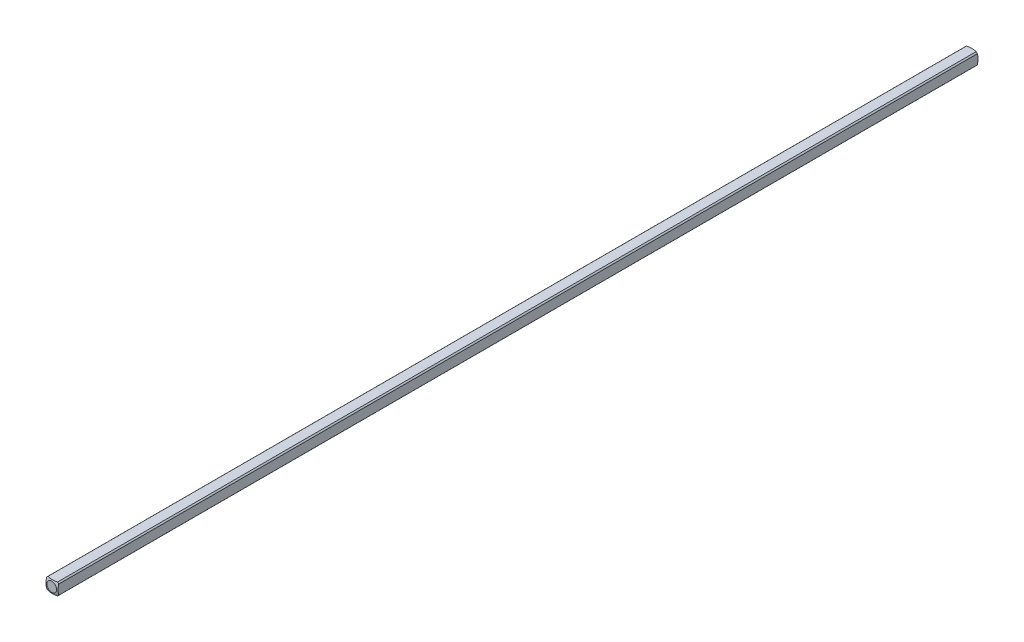
ISO-10303-21;
HEADER;
FILE_DESCRIPTION(('STEP AP214'),'2;1');
FILE_NAME('part.step','',(''),(''),'','','');
FILE_SCHEMA(('AUTOMOTIVE_DESIGN { 1 0 10303 214 1 1 1 1 }'));
ENDSEC;
DATA;
#1=APPLICATION_CONTEXT('core data for automotive mechanical design processes');
#2=APPLICATION_PROTOCOL_DEFINITION('international standard','automotive_design',2000,#1);
#3=PRODUCT_CONTEXT('',#1,'mechanical');
#4=PRODUCT('Part','Part','',(#3));
#5=PRODUCT_RELATED_PRODUCT_CATEGORY('part','',(#4));
#6=PRODUCT_DEFINITION_FORMATION('','',#4);
#7=PRODUCT_DEFINITION_CONTEXT('part definition',#1,'design');
#8=PRODUCT_DEFINITION('design','',#6,#7);
#9=PRODUCT_DEFINITION_SHAPE('','',#8);
#10=(LENGTH_UNIT() NAMED_UNIT(*) SI_UNIT(.MILLI.,.METRE.));
#11=(NAMED_UNIT(*) PLANE_ANGLE_UNIT() SI_UNIT($,.RADIAN.));
#12=(NAMED_UNIT(*) SI_UNIT($,.STERADIAN.) SOLID_ANGLE_UNIT());
#13=UNCERTAINTY_MEASURE_WITH_UNIT(LENGTH_MEASURE(1.E-05),#10,'distance_accuracy_value','');
#14=(GEOMETRIC_REPRESENTATION_CONTEXT(3) GLOBAL_UNCERTAINTY_ASSIGNED_CONTEXT((#13)) GLOBAL_UNIT_ASSIGNED_CONTEXT((#10,
#11,#12)) REPRESENTATION_CONTEXT('',''));
#15=CARTESIAN_POINT('',(0.,0.,0.));
#16=DIRECTION('',(0.,0.,1.));
#17=DIRECTION('',(1.,0.,0.));
#18=AXIS2_PLACEMENT_3D('',#15,#16,#17);
#19=CARTESIAN_POINT('',(-1.5875,-1.5875,120.65));
#20=DIRECTION('',(1.,0.,0.));
#21=DIRECTION('',(0.,0.,-1.));
#22=AXIS2_PLACEMENT_3D('',#19,#20,#21);
#23=PLANE('',#22);
#24=CARTESIAN_POINT('',(-1.5875,0.,4.91912226376204));
#25=DIRECTION('',(1.,0.,0.));
#26=DIRECTION('',(0.,0.,-1.));
#27=AXIS2_PLACEMENT_3D('',#24,#25,#26);
#28=CIRCLE('',#27,4.82558221875869);
#29=CARTESIAN_POINT('',(-1.5875,-1.26841150657032,0.263225357686905));
#30=VERTEX_POINT('',#29);
#31=CARTESIAN_POINT('',(-1.5875,1.26841150657032,0.263225357686955));
#32=VERTEX_POINT('',#31);
#33=EDGE_CURVE('E55',#30,#32,#28,.T.);
#34=ORIENTED_EDGE('',*,*,#33,.F.);
#35=DIRECTION('',(0.,0.,-1.));
#36=VECTOR('',#35,1.);
#37=CARTESIAN_POINT('',(-1.5875,-1.26841150657032,120.65));
#38=LINE('',#37,#36);
#39=CARTESIAN_POINT('',(-1.5875,-1.26841150657032,241.036774642313));
#40=VERTEX_POINT('',#39);
#41=EDGE_CURVE('E48',#40,#30,#38,.T.);
#42=ORIENTED_EDGE('',*,*,#41,.F.);
#43=CARTESIAN_POINT('',(-1.5875,0.,236.380877736238));
#44=DIRECTION('',(-1.,0.,0.));
#45=DIRECTION('',(0.,0.,1.));
#46=AXIS2_PLACEMENT_3D('',#43,#44,#45);
#47=CIRCLE('',#46,4.82558221875869);
#48=CARTESIAN_POINT('',(-1.5875,1.26841150657032,241.036774642313));
#49=VERTEX_POINT('',#48);
#50=EDGE_CURVE('E134',#40,#49,#47,.T.);
#51=ORIENTED_EDGE('',*,*,#50,.T.);
#52=DIRECTION('',(0.,0.,-1.));
#53=VECTOR('',#52,1.);
#54=CARTESIAN_POINT('',(-1.5875,1.26841150657032,120.65));
#55=LINE('',#54,#53);
#56=EDGE_CURVE('E120',#32,#49,#55,.F.);
#57=ORIENTED_EDGE('',*,*,#56,.F.);
#58=EDGE_LOOP('',(#34,#42,#51,#57));
#59=FACE_BOUND('',#58,.T.);
#60=ADVANCED_FACE('F40',(#59),#23,.F.);
#61=CARTESIAN_POINT('',(-1.5875,-1.5875,120.65));
#62=DIRECTION('',(0.,1.,0.));
#63=DIRECTION('',(0.,0.,1.));
#64=AXIS2_PLACEMENT_3D('',#61,#62,#63);
#65=PLANE('',#64);
#66=CARTESIAN_POINT('',(0.,-1.5875,4.91912226376204));
#67=DIRECTION('',(0.,1.,0.));
#68=DIRECTION('',(0.,0.,1.));
#69=AXIS2_PLACEMENT_3D('',#66,#67,#68);
#70=CIRCLE('',#69,4.82558221875869);
#71=CARTESIAN_POINT('',(1.26841150657032,-1.5875,0.263225357686905));
#72=VERTEX_POINT('',#71);
#73=CARTESIAN_POINT('',(-1.26841150657032,-1.5875,0.263225357686933));
#74=VERTEX_POINT('',#73);
#75=EDGE_CURVE('E175',#72,#74,#70,.T.);
#76=ORIENTED_EDGE('',*,*,#75,.F.);
#77=DIRECTION('',(0.,0.,-1.));
#78=VECTOR('',#77,1.);
#79=CARTESIAN_POINT('',(1.26841150657032,-1.5875,120.65));
#80=LINE('',#79,#78);
#81=CARTESIAN_POINT('',(1.26841150657032,-1.5875,241.036774642313));
#82=VERTEX_POINT('',#81);
#83=EDGE_CURVE('E195',#82,#72,#80,.T.);
#84=ORIENTED_EDGE('',*,*,#83,.F.);
#85=CARTESIAN_POINT('',(0.,-1.5875,236.380877736238));
#86=DIRECTION('',(0.,-1.,0.));
#87=DIRECTION('',(0.,0.,-1.));
#88=AXIS2_PLACEMENT_3D('',#85,#86,#87);
#89=CIRCLE('',#88,4.82558221875869);
#90=CARTESIAN_POINT('',(-1.26841150657032,-1.5875,241.036774642313));
#91=VERTEX_POINT('',#90);
#92=EDGE_CURVE('E149',#82,#91,#89,.T.);
#93=ORIENTED_EDGE('',*,*,#92,.T.);
#94=DIRECTION('',(0.,0.,-1.));
#95=VECTOR('',#94,1.);
#96=CARTESIAN_POINT('',(-1.26841150657032,-1.5875,120.65));
#97=LINE('',#96,#95);
#98=EDGE_CURVE('E192',#74,#91,#97,.F.);
#99=ORIENTED_EDGE('',*,*,#98,.F.);
#100=EDGE_LOOP('',(#76,#84,#93,#99));
#101=FACE_BOUND('',#100,.T.);
#102=ADVANCED_FACE('F208',(#101),#65,.F.);
#103=CARTESIAN_POINT('',(1.5875,-1.5875,120.65));
#104=DIRECTION('',(-1.,0.,0.));
#105=DIRECTION('',(0.,0.,1.));
#106=AXIS2_PLACEMENT_3D('',#103,#104,#105);
#107=PLANE('',#106);
#108=CARTESIAN_POINT('',(1.5875,0.,4.91912226376204));
#109=DIRECTION('',(-1.,0.,0.));
#110=DIRECTION('',(0.,0.,1.));
#111=AXIS2_PLACEMENT_3D('',#108,#109,#110);
#112=CIRCLE('',#111,4.82558221875869);
#113=CARTESIAN_POINT('',(1.5875,1.26841150657032,0.263225357686933));
#114=VERTEX_POINT('',#113);
#115=CARTESIAN_POINT('',(1.5875,-1.26841150657032,0.263225357686905));
#116=VERTEX_POINT('',#115);
#117=EDGE_CURVE('E172',#114,#116,#112,.T.);
#118=ORIENTED_EDGE('',*,*,#117,.F.);
#119=DIRECTION('',(0.,0.,-1.));
#120=VECTOR('',#119,1.);
#121=CARTESIAN_POINT('',(1.5875,1.26841150657032,120.65));
#122=LINE('',#121,#120);
#123=CARTESIAN_POINT('',(1.5875,1.26841150657032,241.036774642313));
#124=VERTEX_POINT('',#123);
#125=EDGE_CURVE('E188',#124,#114,#122,.T.);
#126=ORIENTED_EDGE('',*,*,#125,.F.);
#127=CARTESIAN_POINT('',(1.5875,0.,236.380877736238));
#128=DIRECTION('',(1.,0.,0.));
#129=DIRECTION('',(0.,0.,-1.));
#130=AXIS2_PLACEMENT_3D('',#127,#128,#129);
#131=CIRCLE('',#130,4.82558221875869);
#132=CARTESIAN_POINT('',(1.5875,-1.26841150657032,241.036774642313));
#133=VERTEX_POINT('',#132);
#134=EDGE_CURVE('E145',#124,#133,#131,.T.);
#135=ORIENTED_EDGE('',*,*,#134,.T.);
#136=DIRECTION('',(0.,0.,-1.));
#137=VECTOR('',#136,1.);
#138=CARTESIAN_POINT('',(1.5875,-1.26841150657032,120.65));
#139=LINE('',#138,#137);
#140=EDGE_CURVE('E113',#116,#133,#139,.F.);
#141=ORIENTED_EDGE('',*,*,#140,.F.);
#142=EDGE_LOOP('',(#118,#126,#135,#141));
#143=FACE_BOUND('',#142,.T.);
#144=ADVANCED_FACE('F215',(#143),#107,.F.);
#145=CARTESIAN_POINT('',(-1.5875,1.5875,120.65));
#146=DIRECTION('',(0.,-1.,0.));
#147=DIRECTION('',(0.,0.,-1.));
#148=AXIS2_PLACEMENT_3D('',#145,#146,#147);
#149=PLANE('',#148);
#150=CARTESIAN_POINT('',(0.,1.5875,4.91912226376204));
#151=DIRECTION('',(0.,-1.,0.));
#152=DIRECTION('',(0.,0.,-1.));
#153=AXIS2_PLACEMENT_3D('',#150,#151,#152);
#154=CIRCLE('',#153,4.82558221875869);
#155=CARTESIAN_POINT('',(-1.26841150657032,1.5875,0.263225357686933));
#156=VERTEX_POINT('',#155);
#157=CARTESIAN_POINT('',(1.26841150657032,1.5875,0.263225357686905));
#158=VERTEX_POINT('',#157);
#159=EDGE_CURVE('E110',#156,#158,#154,.T.);
#160=ORIENTED_EDGE('',*,*,#159,.F.);
#161=DIRECTION('',(0.,0.,-1.));
#162=VECTOR('',#161,1.);
#163=CARTESIAN_POINT('',(-1.26841150657032,1.5875,120.65));
#164=LINE('',#163,#162);
#165=CARTESIAN_POINT('',(-1.26841150657032,1.5875,241.036774642313));
#166=VERTEX_POINT('',#165);
#167=EDGE_CURVE('E104',#166,#156,#164,.T.);
#168=ORIENTED_EDGE('',*,*,#167,.F.);
#169=CARTESIAN_POINT('',(0.,1.5875,236.380877736238));
#170=DIRECTION('',(0.,1.,0.));
#171=DIRECTION('',(0.,0.,1.));
#172=AXIS2_PLACEMENT_3D('',#169,#170,#171);
#173=CIRCLE('',#172,4.82558221875869);
#174=CARTESIAN_POINT('',(1.26841150657032,1.5875,241.036774642313));
#175=VERTEX_POINT('',#174);
#176=EDGE_CURVE('E109',#166,#175,#173,.T.);
#177=ORIENTED_EDGE('',*,*,#176,.T.);
#178=DIRECTION('',(0.,0.,-1.));
#179=VECTOR('',#178,1.);
#180=CARTESIAN_POINT('',(1.26841150657032,1.5875,120.65));
#181=LINE('',#180,#179);
#182=EDGE_CURVE('E114',#158,#175,#181,.F.);
#183=ORIENTED_EDGE('',*,*,#182,.F.);
#184=EDGE_LOOP('',(#160,#168,#177,#183));
#185=FACE_BOUND('',#184,.T.);
#186=ADVANCED_FACE('F106',(#185),#149,.F.);
#187=CARTESIAN_POINT('',(0.,0.,120.65));
#188=DIRECTION('',(0.,0.,-1.));
#189=DIRECTION('',(-1.,0.,0.));
#190=AXIS2_PLACEMENT_3D('',#187,#188,#189);
#191=CYLINDRICAL_SURFACE('',#190,2.032);
#192=ORIENTED_EDGE('',*,*,#41,.T.);
#193=CARTESIAN_POINT('',(0.,0.,0.263225357686933));
#194=DIRECTION('',(0.,0.,1.));
#195=DIRECTION('',(1.,0.,0.));
#196=AXIS2_PLACEMENT_3D('',#193,#194,#195);
#197=CIRCLE('',#196,2.032);
#198=EDGE_CURVE('E168',#30,#74,#197,.T.);
#199=ORIENTED_EDGE('',*,*,#198,.T.);
#200=ORIENTED_EDGE('',*,*,#98,.T.);
#201=CARTESIAN_POINT('',(0.,0.,241.036774642313));
#202=DIRECTION('',(0.,0.,1.));
#203=DIRECTION('',(1.,0.,0.));
#204=AXIS2_PLACEMENT_3D('',#201,#202,#203);
#205=CIRCLE('',#204,2.032);
#206=EDGE_CURVE('E141',#40,#91,#205,.T.);
#207=ORIENTED_EDGE('',*,*,#206,.F.);
#208=EDGE_LOOP('',(#192,#199,#200,#207));
#209=FACE_BOUND('',#208,.T.);
#210=ADVANCED_FACE('F204',(#209),#191,.T.);
#211=ORIENTED_EDGE('',*,*,#83,.T.);
#212=CARTESIAN_POINT('',(0.,0.,0.263225357686933));
#213=DIRECTION('',(0.,0.,1.));
#214=DIRECTION('',(1.,0.,0.));
#215=AXIS2_PLACEMENT_3D('',#212,#213,#214);
#216=CIRCLE('',#215,2.032);
#217=EDGE_CURVE('E61',#72,#116,#216,.T.);
#218=ORIENTED_EDGE('',*,*,#217,.T.);
#219=ORIENTED_EDGE('',*,*,#140,.T.);
#220=CARTESIAN_POINT('',(0.,0.,241.036774642313));
#221=DIRECTION('',(0.,0.,1.));
#222=DIRECTION('',(1.,0.,0.));
#223=AXIS2_PLACEMENT_3D('',#220,#221,#222);
#224=CIRCLE('',#223,2.032);
#225=EDGE_CURVE('E153',#82,#133,#224,.T.);
#226=ORIENTED_EDGE('',*,*,#225,.F.);
#227=EDGE_LOOP('',(#211,#218,#219,#226));
#228=FACE_BOUND('',#227,.T.);
#229=ADVANCED_FACE('F211',(#228),#191,.T.);
#230=ORIENTED_EDGE('',*,*,#125,.T.);
#231=CARTESIAN_POINT('',(0.,0.,0.263225357686933));
#232=DIRECTION('',(0.,0.,1.));
#233=DIRECTION('',(1.,0.,0.));
#234=AXIS2_PLACEMENT_3D('',#231,#232,#233);
#235=CIRCLE('',#234,2.032);
#236=EDGE_CURVE('E164',#114,#158,#235,.T.);
#237=ORIENTED_EDGE('',*,*,#236,.T.);
#238=ORIENTED_EDGE('',*,*,#182,.T.);
#239=CARTESIAN_POINT('',(0.,0.,241.036774642313));
#240=DIRECTION('',(0.,0.,1.));
#241=DIRECTION('',(1.,0.,0.));
#242=AXIS2_PLACEMENT_3D('',#239,#240,#241);
#243=CIRCLE('',#242,2.032);
#244=EDGE_CURVE('E132',#124,#175,#243,.T.);
#245=ORIENTED_EDGE('',*,*,#244,.F.);
#246=EDGE_LOOP('',(#230,#237,#238,#245));
#247=FACE_BOUND('',#246,.T.);
#248=ADVANCED_FACE('F217',(#247),#191,.T.);
#249=ORIENTED_EDGE('',*,*,#167,.T.);
#250=CARTESIAN_POINT('',(0.,0.,0.263225357686933));
#251=DIRECTION('',(0.,0.,1.));
#252=DIRECTION('',(1.,0.,0.));
#253=AXIS2_PLACEMENT_3D('',#250,#251,#252);
#254=CIRCLE('',#253,2.032);
#255=EDGE_CURVE('E12',#156,#32,#254,.T.);
#256=ORIENTED_EDGE('',*,*,#255,.T.);
#257=ORIENTED_EDGE('',*,*,#56,.T.);
#258=CARTESIAN_POINT('',(0.,0.,241.036774642313));
#259=DIRECTION('',(0.,0.,1.));
#260=DIRECTION('',(1.,0.,0.));
#261=AXIS2_PLACEMENT_3D('',#258,#259,#260);
#262=CIRCLE('',#261,2.032);
#263=EDGE_CURVE('E117',#166,#49,#262,.T.);
#264=ORIENTED_EDGE('',*,*,#263,.F.);
#265=EDGE_LOOP('',(#249,#256,#257,#264));
#266=FACE_BOUND('',#265,.T.);
#267=ADVANCED_FACE('F118',(#266),#191,.T.);
#268=CARTESIAN_POINT('',(0.,0.,4.91912226376204));
#269=DIRECTION('',(0.,0.,1.));
#270=DIRECTION('',(-1.,0.,0.));
#271=AXIS2_PLACEMENT_3D('',#268,#269,#270);
#272=SPHERICAL_SURFACE('',#271,5.08);
#273=CARTESIAN_POINT('',(0.,0.,0.));
#274=DIRECTION('',(0.,0.,-1.));
#275=DIRECTION('',(-1.,0.,0.));
#276=AXIS2_PLACEMENT_3D('',#273,#274,#275);
#277=CIRCLE('',#276,1.26832020963187);
#278=CARTESIAN_POINT('',(-1.26832020963187,0.,0.));
#279=VERTEX_POINT('',#278);
#280=EDGE_CURVE('E180',#279,#279,#277,.T.);
#281=ORIENTED_EDGE('',*,*,#280,.F.);
#282=EDGE_LOOP('',(#281));
#283=FACE_BOUND('',#282,.T.);
#284=ORIENTED_EDGE('',*,*,#75,.T.);
#285=ORIENTED_EDGE('',*,*,#198,.F.);
#286=ORIENTED_EDGE('',*,*,#33,.T.);
#287=ORIENTED_EDGE('',*,*,#255,.F.);
#288=ORIENTED_EDGE('',*,*,#159,.T.);
#289=ORIENTED_EDGE('',*,*,#236,.F.);
#290=ORIENTED_EDGE('',*,*,#117,.T.);
#291=ORIENTED_EDGE('',*,*,#217,.F.);
#292=EDGE_LOOP('',(#284,#285,#286,#287,#288,#289,#290,#291));
#293=FACE_BOUND('',#292,.T.);
#294=ADVANCED_FACE('F218',(#283,#293),#272,.T.);
#295=CARTESIAN_POINT('',(0.,0.,0.));
#296=DIRECTION('',(0.,0.,-1.));
#297=DIRECTION('',(-1.,0.,0.));
#298=AXIS2_PLACEMENT_3D('',#295,#296,#297);
#299=PLANE('',#298);
#300=ORIENTED_EDGE('',*,*,#280,.T.);
#301=EDGE_LOOP('',(#300));
#302=FACE_BOUND('',#301,.T.);
#303=ADVANCED_FACE('F220',(#302),#299,.T.);
#304=CARTESIAN_POINT('',(0.,0.,236.380877736238));
#305=DIRECTION('',(0.,0.,-1.));
#306=DIRECTION('',(-1.,0.,0.));
#307=AXIS2_PLACEMENT_3D('',#304,#305,#306);
#308=SPHERICAL_SURFACE('',#307,5.08);
#309=CARTESIAN_POINT('',(0.,0.,241.3));
#310=DIRECTION('',(0.,0.,-1.));
#311=DIRECTION('',(-1.,0.,0.));
#312=AXIS2_PLACEMENT_3D('',#309,#310,#311);
#313=CIRCLE('',#312,1.26832020963187);
#314=CARTESIAN_POINT('',(-1.26832020963187,0.,241.3));
#315=VERTEX_POINT('',#314);
#316=EDGE_CURVE('E125',#315,#315,#313,.T.);
#317=ORIENTED_EDGE('',*,*,#316,.T.);
#318=EDGE_LOOP('',(#317));
#319=FACE_BOUND('',#318,.T.);
#320=ORIENTED_EDGE('',*,*,#92,.F.);
#321=ORIENTED_EDGE('',*,*,#225,.T.);
#322=ORIENTED_EDGE('',*,*,#134,.F.);
#323=ORIENTED_EDGE('',*,*,#244,.T.);
#324=ORIENTED_EDGE('',*,*,#176,.F.);
#325=ORIENTED_EDGE('',*,*,#263,.T.);
#326=ORIENTED_EDGE('',*,*,#50,.F.);
#327=ORIENTED_EDGE('',*,*,#206,.T.);
#328=EDGE_LOOP('',(#320,#321,#322,#323,#324,#325,#326,#327));
#329=FACE_BOUND('',#328,.T.);
#330=ADVANCED_FACE('F129',(#319,#329),#308,.T.);
#331=CARTESIAN_POINT('',(0.,0.,241.3));
#332=DIRECTION('',(0.,0.,1.));
#333=DIRECTION('',(-1.,0.,0.));
#334=AXIS2_PLACEMENT_3D('',#331,#332,#333);
#335=PLANE('',#334);
#336=ORIENTED_EDGE('',*,*,#316,.F.);
#337=EDGE_LOOP('',(#336));
#338=FACE_BOUND('',#337,.T.);
#339=ADVANCED_FACE('F265',(#338),#335,.T.);
#340=CLOSED_SHELL('',(#60,#102,#144,#186,#210,#229,#248,#267,#294,#303,#330,#339));
#341=MANIFOLD_SOLID_BREP('B2',#340);
#342=ADVANCED_BREP_SHAPE_REPRESENTATION('',(#18,#341),#14);
#343=SHAPE_DEFINITION_REPRESENTATION(#9,#342);
ENDSEC;
END-ISO-10303-21;
